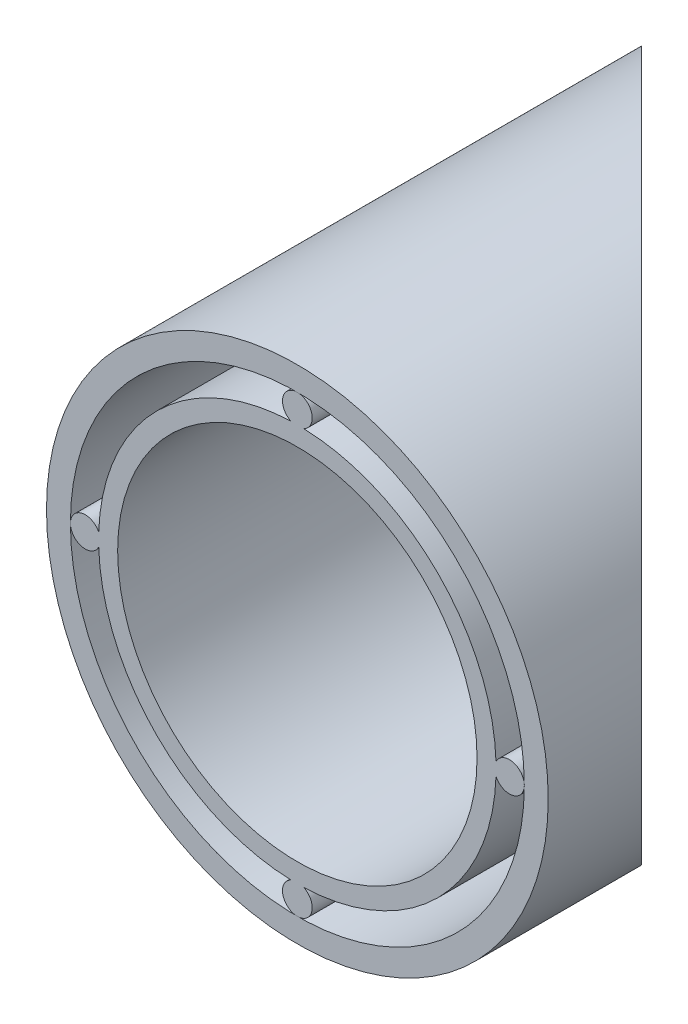
ISO-10303-21;
HEADER;
FILE_DESCRIPTION(('STEP AP214'),'2;1');
FILE_NAME('part.step','',(''),(''),'','','');
FILE_SCHEMA(('AUTOMOTIVE_DESIGN { 1 0 10303 214 1 1 1 1 }'));
ENDSEC;
DATA;
#1=APPLICATION_CONTEXT('core data for automotive mechanical design processes');
#2=APPLICATION_PROTOCOL_DEFINITION('international standard','automotive_design',2000,#1);
#3=PRODUCT_CONTEXT('',#1,'mechanical');
#4=PRODUCT('Part','Part','',(#3));
#5=PRODUCT_RELATED_PRODUCT_CATEGORY('part','',(#4));
#6=PRODUCT_DEFINITION_FORMATION('','',#4);
#7=PRODUCT_DEFINITION_CONTEXT('part definition',#1,'design');
#8=PRODUCT_DEFINITION('design','',#6,#7);
#9=PRODUCT_DEFINITION_SHAPE('','',#8);
#10=(LENGTH_UNIT() NAMED_UNIT(*) SI_UNIT(.MILLI.,.METRE.));
#11=(NAMED_UNIT(*) PLANE_ANGLE_UNIT() SI_UNIT($,.RADIAN.));
#12=(NAMED_UNIT(*) SI_UNIT($,.STERADIAN.) SOLID_ANGLE_UNIT());
#13=UNCERTAINTY_MEASURE_WITH_UNIT(LENGTH_MEASURE(1.E-05),#10,'distance_accuracy_value','');
#14=(GEOMETRIC_REPRESENTATION_CONTEXT(3) GLOBAL_UNCERTAINTY_ASSIGNED_CONTEXT((#13)) GLOBAL_UNIT_ASSIGNED_CONTEXT((#10,
#11,#12)) REPRESENTATION_CONTEXT('',''));
#15=CARTESIAN_POINT('',(0.,0.,0.));
#16=DIRECTION('',(0.,0.,1.));
#17=DIRECTION('',(1.,0.,0.));
#18=AXIS2_PLACEMENT_3D('',#15,#16,#17);
#19=CARTESIAN_POINT('',(0.,0.,-50.));
#20=DIRECTION('',(0.,0.,1.));
#21=DIRECTION('',(1.,0.,0.));
#22=AXIS2_PLACEMENT_3D('',#19,#20,#21);
#23=CYLINDRICAL_SURFACE('',#22,16.7);
#24=CARTESIAN_POINT('',(0.,0.,-28.9200000000002));
#25=DIRECTION('',(-0.707106781186544,0.,0.707106781186551));
#26=DIRECTION('',(0.707106781186551,0.,0.707106781186544));
#27=AXIS2_PLACEMENT_3D('',#24,#25,#26);
#28=ELLIPSE('',#27,23.6173664916306,16.7);
#29=CARTESIAN_POINT('',(0.537271772936991,16.6913552188553,-28.3827282270633));
#30=VERTEX_POINT('',#29);
#31=CARTESIAN_POINT('',(16.6913552188552,0.537271772936576,-12.2286447811452));
#32=VERTEX_POINT('',#31);
#33=EDGE_CURVE('E59',#30,#32,#28,.F.);
#34=ORIENTED_EDGE('',*,*,#33,.F.);
#35=DIRECTION('',(0.,0.,1.));
#36=VECTOR('',#35,1.);
#37=CARTESIAN_POINT('',(0.537271772936991,16.6913552188553,-25.));
#38=LINE('',#37,#36);
#39=CARTESIAN_POINT('',(0.537271772936992,16.6913552188553,0.));
#40=VERTEX_POINT('',#39);
#41=EDGE_CURVE('E131',#40,#30,#38,.F.);
#42=ORIENTED_EDGE('',*,*,#41,.F.);
#43=CARTESIAN_POINT('',(0.,0.,0.));
#44=DIRECTION('',(0.,0.,1.));
#45=DIRECTION('',(1.,0.,0.));
#46=AXIS2_PLACEMENT_3D('',#43,#44,#45);
#47=CIRCLE('',#46,16.7);
#48=CARTESIAN_POINT('',(16.6913552188552,0.537271772936566,0.));
#49=VERTEX_POINT('',#48);
#50=EDGE_CURVE('E154',#49,#40,#47,.T.);
#51=ORIENTED_EDGE('',*,*,#50,.F.);
#52=DIRECTION('',(0.,0.,1.));
#53=VECTOR('',#52,1.);
#54=CARTESIAN_POINT('',(16.6913552188552,0.537271772936576,-25.));
#55=LINE('',#54,#53);
#56=EDGE_CURVE('E66',#32,#49,#55,.T.);
#57=ORIENTED_EDGE('',*,*,#56,.F.);
#58=EDGE_LOOP('',(#34,#42,#51,#57));
#59=FACE_BOUND('',#58,.T.);
#60=ADVANCED_FACE('F45',(#59),#23,.T.);
#61=CARTESIAN_POINT('',(0.,0.,-28.9200000000002));
#62=DIRECTION('',(-0.707106781186544,0.,0.707106781186551));
#63=DIRECTION('',(0.707106781186551,0.,0.707106781186544));
#64=AXIS2_PLACEMENT_3D('',#61,#62,#63);
#65=ELLIPSE('',#64,23.6173664916306,16.7);
#66=CARTESIAN_POINT('',(-16.6913552188553,0.537271772936932,-45.6113552188553));
#67=VERTEX_POINT('',#66);
#68=CARTESIAN_POINT('',(-0.537271772936756,16.6913552188553,-29.457271772937));
#69=VERTEX_POINT('',#68);
#70=EDGE_CURVE('E173',#67,#69,#65,.F.);
#71=ORIENTED_EDGE('',*,*,#70,.F.);
#72=DIRECTION('',(0.,0.,1.));
#73=VECTOR('',#72,1.);
#74=CARTESIAN_POINT('',(-16.6913552188553,0.537271772936932,-25.));
#75=LINE('',#74,#73);
#76=CARTESIAN_POINT('',(-16.6913552188553,0.537271772936932,0.));
#77=VERTEX_POINT('',#76);
#78=EDGE_CURVE('E139',#77,#67,#75,.F.);
#79=ORIENTED_EDGE('',*,*,#78,.F.);
#80=CARTESIAN_POINT('',(-0.537271772936775,16.6913552188552,0.));
#81=VERTEX_POINT('',#80);
#82=EDGE_CURVE('E156',#81,#77,#47,.T.);
#83=ORIENTED_EDGE('',*,*,#82,.F.);
#84=DIRECTION('',(0.,0.,1.));
#85=VECTOR('',#84,1.);
#86=CARTESIAN_POINT('',(-0.537271772936756,16.6913552188553,-25.));
#87=LINE('',#86,#85);
#88=EDGE_CURVE('E134',#69,#81,#87,.T.);
#89=ORIENTED_EDGE('',*,*,#88,.F.);
#90=EDGE_LOOP('',(#71,#79,#83,#89));
#91=FACE_BOUND('',#90,.T.);
#92=ADVANCED_FACE('F172',(#91),#23,.T.);
#93=CARTESIAN_POINT('',(0.,0.,-28.9200000000002));
#94=DIRECTION('',(-0.707106781186544,0.,0.707106781186551));
#95=DIRECTION('',(0.707106781186551,0.,0.707106781186544));
#96=AXIS2_PLACEMENT_3D('',#93,#94,#95);
#97=ELLIPSE('',#96,23.6173664916306,16.7);
#98=CARTESIAN_POINT('',(-0.537271772936874,-16.6913552188553,-29.4572717729371));
#99=VERTEX_POINT('',#98);
#100=CARTESIAN_POINT('',(-16.6913552188553,-0.537271772936815,-45.6113552188553));
#101=VERTEX_POINT('',#100);
#102=EDGE_CURVE('E176',#99,#101,#97,.F.);
#103=ORIENTED_EDGE('',*,*,#102,.F.);
#104=DIRECTION('',(0.,0.,1.));
#105=VECTOR('',#104,1.);
#106=CARTESIAN_POINT('',(-0.537271772936874,-16.6913552188553,-25.));
#107=LINE('',#106,#105);
#108=CARTESIAN_POINT('',(-0.537271772936875,-16.6913552188553,0.));
#109=VERTEX_POINT('',#108);
#110=EDGE_CURVE('E147',#109,#99,#107,.F.);
#111=ORIENTED_EDGE('',*,*,#110,.F.);
#112=CARTESIAN_POINT('',(-16.6913552188552,-0.537271772936834,0.));
#113=VERTEX_POINT('',#112);
#114=EDGE_CURVE('E153',#113,#109,#47,.T.);
#115=ORIENTED_EDGE('',*,*,#114,.F.);
#116=DIRECTION('',(0.,0.,1.));
#117=VECTOR('',#116,1.);
#118=CARTESIAN_POINT('',(-16.6913552188553,-0.537271772936815,-25.));
#119=LINE('',#118,#117);
#120=EDGE_CURVE('E142',#101,#113,#119,.T.);
#121=ORIENTED_EDGE('',*,*,#120,.F.);
#122=EDGE_LOOP('',(#103,#111,#115,#121));
#123=FACE_BOUND('',#122,.T.);
#124=ADVANCED_FACE('F199',(#123),#23,.T.);
#125=CARTESIAN_POINT('',(0.,0.,-28.9200000000002));
#126=DIRECTION('',(-0.707106781186544,0.,0.707106781186551));
#127=DIRECTION('',(0.707106781186551,0.,0.707106781186544));
#128=AXIS2_PLACEMENT_3D('',#125,#126,#127);
#129=ELLIPSE('',#128,23.6173664916306,16.7);
#130=CARTESIAN_POINT('',(16.6913552188552,-0.537271772936928,-12.2286447811452));
#131=VERTEX_POINT('',#130);
#132=CARTESIAN_POINT('',(0.537271772936874,-16.6913552188553,-28.3827282270634));
#133=VERTEX_POINT('',#132);
#134=EDGE_CURVE('E109',#131,#133,#129,.F.);
#135=ORIENTED_EDGE('',*,*,#134,.F.);
#136=DIRECTION('',(0.,0.,1.));
#137=VECTOR('',#136,1.);
#138=CARTESIAN_POINT('',(16.6913552188552,-0.537271772936928,-25.));
#139=LINE('',#138,#137);
#140=CARTESIAN_POINT('',(16.6913552188552,-0.537271772936928,0.));
#141=VERTEX_POINT('',#140);
#142=EDGE_CURVE('E116',#141,#131,#139,.F.);
#143=ORIENTED_EDGE('',*,*,#142,.F.);
#144=CARTESIAN_POINT('',(0.537271772936892,-16.6913552188552,0.));
#145=VERTEX_POINT('',#144);
#146=EDGE_CURVE('E53',#145,#141,#47,.T.);
#147=ORIENTED_EDGE('',*,*,#146,.F.);
#148=DIRECTION('',(0.,0.,1.));
#149=VECTOR('',#148,1.);
#150=CARTESIAN_POINT('',(0.537271772936874,-16.6913552188553,-25.));
#151=LINE('',#150,#149);
#152=EDGE_CURVE('E118',#133,#145,#151,.T.);
#153=ORIENTED_EDGE('',*,*,#152,.F.);
#154=EDGE_LOOP('',(#135,#143,#147,#153));
#155=FACE_BOUND('',#154,.T.);
#156=ADVANCED_FACE('F47',(#155),#23,.T.);
#157=CARTESIAN_POINT('',(0.,0.,0.));
#158=DIRECTION('',(0.,0.,1.));
#159=DIRECTION('',(1.,0.,0.));
#160=AXIS2_PLACEMENT_3D('',#157,#158,#159);
#161=PLANE('',#160);
#162=ORIENTED_EDGE('',*,*,#146,.T.);
#163=CARTESIAN_POINT('',(17.82,-1.86654592374554E-13,0.));
#164=DIRECTION('',(0.,0.,1.));
#165=DIRECTION('',(1.,0.,0.));
#166=AXIS2_PLACEMENT_3D('',#163,#164,#165);
#167=CIRCLE('',#166,1.25);
#168=EDGE_CURVE('E121',#141,#49,#167,.T.);
#169=ORIENTED_EDGE('',*,*,#168,.T.);
#170=ORIENTED_EDGE('',*,*,#50,.T.);
#171=CARTESIAN_POINT('',(1.24436394916369E-13,17.82,0.));
#172=DIRECTION('',(0.,0.,1.));
#173=DIRECTION('',(1.,0.,0.));
#174=AXIS2_PLACEMENT_3D('',#171,#172,#173);
#175=CIRCLE('',#174,1.25);
#176=EDGE_CURVE('E123',#40,#81,#175,.T.);
#177=ORIENTED_EDGE('',*,*,#176,.T.);
#178=ORIENTED_EDGE('',*,*,#82,.T.);
#179=CARTESIAN_POINT('',(-17.82,0.,0.));
#180=DIRECTION('',(0.,0.,1.));
#181=DIRECTION('',(1.,0.,0.));
#182=AXIS2_PLACEMENT_3D('',#179,#180,#181);
#183=CIRCLE('',#182,1.25);
#184=EDGE_CURVE('E136',#77,#113,#183,.T.);
#185=ORIENTED_EDGE('',*,*,#184,.T.);
#186=ORIENTED_EDGE('',*,*,#114,.T.);
#187=CARTESIAN_POINT('',(0.,-17.82,0.));
#188=DIRECTION('',(0.,0.,1.));
#189=DIRECTION('',(1.,0.,0.));
#190=AXIS2_PLACEMENT_3D('',#187,#188,#189);
#191=CIRCLE('',#190,1.25);
#192=EDGE_CURVE('E144',#109,#145,#191,.T.);
#193=ORIENTED_EDGE('',*,*,#192,.T.);
#194=EDGE_LOOP('',(#162,#169,#170,#177,#178,#185,#186,#193));
#195=FACE_BOUND('',#194,.T.);
#196=CARTESIAN_POINT('',(0.,0.,0.));
#197=DIRECTION('',(0.,0.,1.));
#198=DIRECTION('',(1.,0.,0.));
#199=AXIS2_PLACEMENT_3D('',#196,#197,#198);
#200=CIRCLE('',#199,15.1);
#201=CARTESIAN_POINT('',(15.1,0.,0.));
#202=VERTEX_POINT('',#201);
#203=EDGE_CURVE('E151',#202,#202,#200,.T.);
#204=ORIENTED_EDGE('',*,*,#203,.F.);
#205=EDGE_LOOP('',(#204));
#206=FACE_BOUND('',#205,.T.);
#207=ADVANCED_FACE('F161',(#195,#206),#161,.T.);
#208=CARTESIAN_POINT('',(0.,0.,-50.));
#209=DIRECTION('',(0.,0.,1.));
#210=DIRECTION('',(1.,0.,0.));
#211=AXIS2_PLACEMENT_3D('',#208,#209,#210);
#212=CYLINDRICAL_SURFACE('',#211,15.1);
#213=CARTESIAN_POINT('',(0.,0.,-28.9200000000002));
#214=DIRECTION('',(-0.707106781186544,0.,0.707106781186551));
#215=DIRECTION('',(0.707106781186551,0.,0.707106781186544));
#216=AXIS2_PLACEMENT_3D('',#213,#214,#215);
#217=ELLIPSE('',#216,21.3546247918336,15.1);
#218=CARTESIAN_POINT('',(15.1,0.,-13.8200000000004));
#219=VERTEX_POINT('',#218);
#220=EDGE_CURVE('E125',#219,#219,#217,.F.);
#221=ORIENTED_EDGE('',*,*,#220,.T.);
#222=EDGE_LOOP('',(#221));
#223=FACE_BOUND('',#222,.T.);
#224=ORIENTED_EDGE('',*,*,#203,.T.);
#225=EDGE_LOOP('',(#224));
#226=FACE_BOUND('',#225,.T.);
#227=ADVANCED_FACE('F185',(#223,#226),#212,.F.);
#228=CARTESIAN_POINT('',(0.,-17.82,-50.));
#229=DIRECTION('',(0.,0.,1.));
#230=DIRECTION('',(1.,0.,0.));
#231=AXIS2_PLACEMENT_3D('',#228,#229,#230);
#232=CYLINDRICAL_SURFACE('',#231,1.25);
#233=CARTESIAN_POINT('',(0.,-17.82,-28.9200000000002));
#234=DIRECTION('',(-0.707106781186544,0.,0.707106781186551));
#235=DIRECTION('',(0.707106781186551,0.,0.707106781186544));
#236=AXIS2_PLACEMENT_3D('',#233,#234,#235);
#237=ELLIPSE('',#236,1.76776695296636,1.25);
#238=EDGE_CURVE('E179',#133,#99,#237,.F.);
#239=ORIENTED_EDGE('',*,*,#238,.F.);
#240=ORIENTED_EDGE('',*,*,#152,.T.);
#241=ORIENTED_EDGE('',*,*,#192,.F.);
#242=ORIENTED_EDGE('',*,*,#110,.T.);
#243=EDGE_LOOP('',(#239,#240,#241,#242));
#244=FACE_BOUND('',#243,.T.);
#245=ADVANCED_FACE('F211',(#244),#232,.T.);
#246=CARTESIAN_POINT('',(-17.82,0.,-50.));
#247=DIRECTION('',(0.,0.,1.));
#248=DIRECTION('',(1.,0.,0.));
#249=AXIS2_PLACEMENT_3D('',#246,#247,#248);
#250=CYLINDRICAL_SURFACE('',#249,1.25);
#251=CARTESIAN_POINT('',(-17.82,0.,-46.74));
#252=DIRECTION('',(-0.707106781186544,0.,0.707106781186551));
#253=DIRECTION('',(0.707106781186551,0.,0.707106781186544));
#254=AXIS2_PLACEMENT_3D('',#251,#252,#253);
#255=ELLIPSE('',#254,1.76776695296636,1.25);
#256=EDGE_CURVE('E175',#101,#67,#255,.F.);
#257=ORIENTED_EDGE('',*,*,#256,.F.);
#258=ORIENTED_EDGE('',*,*,#120,.T.);
#259=ORIENTED_EDGE('',*,*,#184,.F.);
#260=ORIENTED_EDGE('',*,*,#78,.T.);
#261=EDGE_LOOP('',(#257,#258,#259,#260));
#262=FACE_BOUND('',#261,.T.);
#263=ADVANCED_FACE('F169',(#262),#250,.T.);
#264=CARTESIAN_POINT('',(1.24436394916369E-13,17.82,-50.));
#265=DIRECTION('',(0.,0.,1.));
#266=DIRECTION('',(1.,0.,0.));
#267=AXIS2_PLACEMENT_3D('',#264,#265,#266);
#268=CYLINDRICAL_SURFACE('',#267,1.25);
#269=CARTESIAN_POINT('',(1.24436394916369E-13,17.82,-28.9200000000001));
#270=DIRECTION('',(-0.707106781186544,0.,0.707106781186551));
#271=DIRECTION('',(0.707106781186551,0.,0.707106781186544));
#272=AXIS2_PLACEMENT_3D('',#269,#270,#271);
#273=ELLIPSE('',#272,1.76776695296636,1.25);
#274=EDGE_CURVE('E212',#69,#30,#273,.F.);
#275=ORIENTED_EDGE('',*,*,#274,.F.);
#276=ORIENTED_EDGE('',*,*,#88,.T.);
#277=ORIENTED_EDGE('',*,*,#176,.F.);
#278=ORIENTED_EDGE('',*,*,#41,.T.);
#279=EDGE_LOOP('',(#275,#276,#277,#278));
#280=FACE_BOUND('',#279,.T.);
#281=ADVANCED_FACE('F192',(#280),#268,.T.);
#282=CARTESIAN_POINT('',(17.82,-1.86654592374554E-13,-50.));
#283=DIRECTION('',(0.,0.,1.));
#284=DIRECTION('',(1.,0.,0.));
#285=AXIS2_PLACEMENT_3D('',#282,#283,#284);
#286=CYLINDRICAL_SURFACE('',#285,1.25);
#287=CARTESIAN_POINT('',(17.82,-1.86654592374554E-13,-11.1000000000004));
#288=DIRECTION('',(-0.707106781186544,0.,0.707106781186551));
#289=DIRECTION('',(0.707106781186551,0.,0.707106781186544));
#290=AXIS2_PLACEMENT_3D('',#287,#288,#289);
#291=ELLIPSE('',#290,1.76776695296636,1.25);
#292=EDGE_CURVE('E12',#32,#131,#291,.F.);
#293=ORIENTED_EDGE('',*,*,#292,.F.);
#294=ORIENTED_EDGE('',*,*,#56,.T.);
#295=ORIENTED_EDGE('',*,*,#168,.F.);
#296=ORIENTED_EDGE('',*,*,#142,.T.);
#297=EDGE_LOOP('',(#293,#294,#295,#296));
#298=FACE_BOUND('',#297,.T.);
#299=ADVANCED_FACE('F120',(#298),#286,.T.);
#300=CARTESIAN_POINT('',(-21.08,-76.5,-50.));
#301=DIRECTION('',(-0.707106781186544,0.,0.707106781186551));
#302=DIRECTION('',(0.707106781186551,0.,0.707106781186544));
#303=AXIS2_PLACEMENT_3D('',#300,#301,#302);
#304=PLANE('',#303);
#305=ORIENTED_EDGE('',*,*,#256,.T.);
#306=ORIENTED_EDGE('',*,*,#70,.T.);
#307=ORIENTED_EDGE('',*,*,#274,.T.);
#308=ORIENTED_EDGE('',*,*,#33,.T.);
#309=ORIENTED_EDGE('',*,*,#292,.T.);
#310=ORIENTED_EDGE('',*,*,#134,.T.);
#311=ORIENTED_EDGE('',*,*,#238,.T.);
#312=ORIENTED_EDGE('',*,*,#102,.T.);
#313=EDGE_LOOP('',(#305,#306,#307,#308,#309,#310,#311,#312));
#314=FACE_BOUND('',#313,.T.);
#315=ORIENTED_EDGE('',*,*,#220,.F.);
#316=EDGE_LOOP('',(#315));
#317=FACE_BOUND('',#316,.T.);
#318=ADVANCED_FACE('F107',(#314,#317),#304,.F.);
#319=CLOSED_SHELL('',(#60,#92,#124,#156,#207,#227,#245,#263,#281,#299,#318));
#320=MANIFOLD_SOLID_BREP('B2',#319);
#321=CARTESIAN_POINT('',(0.,0.,-50.));
#322=DIRECTION('',(0.,0.,1.));
#323=DIRECTION('',(1.,0.,0.));
#324=AXIS2_PLACEMENT_3D('',#321,#322,#323);
#325=CYLINDRICAL_SURFACE('',#324,21.08);
#326=CARTESIAN_POINT('',(0.,0.,-28.9200000000002));
#327=DIRECTION('',(-0.707106781186544,0.,0.707106781186551));
#328=DIRECTION('',(0.707106781186551,0.,0.707106781186544));
#329=AXIS2_PLACEMENT_3D('',#326,#327,#328);
#330=ELLIPSE('',#329,29.8116218948247,21.08);
#331=CARTESIAN_POINT('',(21.08,0.,-7.84000000000046));
#332=VERTEX_POINT('',#331);
#333=EDGE_CURVE('E311',#332,#332,#330,.F.);
#334=ORIENTED_EDGE('',*,*,#333,.F.);
#335=EDGE_LOOP('',(#334));
#336=FACE_BOUND('',#335,.T.);
#337=CARTESIAN_POINT('',(0.,0.,0.));
#338=DIRECTION('',(0.,0.,1.));
#339=DIRECTION('',(1.,0.,0.));
#340=AXIS2_PLACEMENT_3D('',#337,#338,#339);
#341=CIRCLE('',#340,21.08);
#342=CARTESIAN_POINT('',(21.08,0.,0.));
#343=VERTEX_POINT('',#342);
#344=EDGE_CURVE('E44',#343,#343,#341,.T.);
#345=ORIENTED_EDGE('',*,*,#344,.F.);
#346=EDGE_LOOP('',(#345));
#347=FACE_BOUND('',#346,.T.);
#348=ADVANCED_FACE('F300',(#336,#347),#325,.T.);
#349=CARTESIAN_POINT('',(0.,0.,0.));
#350=DIRECTION('',(0.,0.,1.));
#351=DIRECTION('',(1.,0.,0.));
#352=AXIS2_PLACEMENT_3D('',#349,#350,#351);
#353=PLANE('',#352);
#354=CARTESIAN_POINT('',(0.,0.,0.));
#355=DIRECTION('',(0.,0.,1.));
#356=DIRECTION('',(1.,0.,0.));
#357=AXIS2_PLACEMENT_3D('',#354,#355,#356);
#358=CIRCLE('',#357,19.07);
#359=CARTESIAN_POINT('',(19.07,0.,0.));
#360=VERTEX_POINT('',#359);
#361=EDGE_CURVE('E307',#360,#360,#358,.T.);
#362=ORIENTED_EDGE('',*,*,#361,.F.);
#363=EDGE_LOOP('',(#362));
#364=FACE_BOUND('',#363,.T.);
#365=ORIENTED_EDGE('',*,*,#344,.T.);
#366=EDGE_LOOP('',(#365));
#367=FACE_BOUND('',#366,.T.);
#368=ADVANCED_FACE('F329',(#364,#367),#353,.T.);
#369=CARTESIAN_POINT('',(0.,0.,-50.));
#370=DIRECTION('',(0.,0.,1.));
#371=DIRECTION('',(1.,0.,0.));
#372=AXIS2_PLACEMENT_3D('',#369,#370,#371);
#373=CYLINDRICAL_SURFACE('',#372,19.07);
#374=CARTESIAN_POINT('',(0.,0.,-28.9200000000002));
#375=DIRECTION('',(-0.707106781186544,0.,0.707106781186551));
#376=DIRECTION('',(0.707106781186551,0.,0.707106781186544));
#377=AXIS2_PLACEMENT_3D('',#374,#375,#376);
#378=ELLIPSE('',#377,26.9690526344548,19.07);
#379=CARTESIAN_POINT('',(19.07,0.,-9.85000000000044));
#380=VERTEX_POINT('',#379);
#381=EDGE_CURVE('E303',#380,#380,#378,.F.);
#382=ORIENTED_EDGE('',*,*,#381,.T.);
#383=EDGE_LOOP('',(#382));
#384=FACE_BOUND('',#383,.T.);
#385=ORIENTED_EDGE('',*,*,#361,.T.);
#386=EDGE_LOOP('',(#385));
#387=FACE_BOUND('',#386,.T.);
#388=ADVANCED_FACE('F320',(#384,#387),#373,.F.);
#389=CARTESIAN_POINT('',(-21.08,-76.5,-50.));
#390=DIRECTION('',(-0.707106781186544,0.,0.707106781186551));
#391=DIRECTION('',(0.707106781186551,0.,0.707106781186544));
#392=AXIS2_PLACEMENT_3D('',#389,#390,#391);
#393=PLANE('',#392);
#394=ORIENTED_EDGE('',*,*,#333,.T.);
#395=EDGE_LOOP('',(#394));
#396=FACE_BOUND('',#395,.T.);
#397=ORIENTED_EDGE('',*,*,#381,.F.);
#398=EDGE_LOOP('',(#397));
#399=FACE_BOUND('',#398,.T.);
#400=ADVANCED_FACE('F323',(#396,#399),#393,.F.);
#401=CLOSED_SHELL('',(#348,#368,#388,#400));
#402=MANIFOLD_SOLID_BREP('B6',#401);
#403=ADVANCED_BREP_SHAPE_REPRESENTATION('',(#18,#320,#402),#14);
#404=SHAPE_DEFINITION_REPRESENTATION(#9,#403);
ENDSEC;
END-ISO-10303-21;
